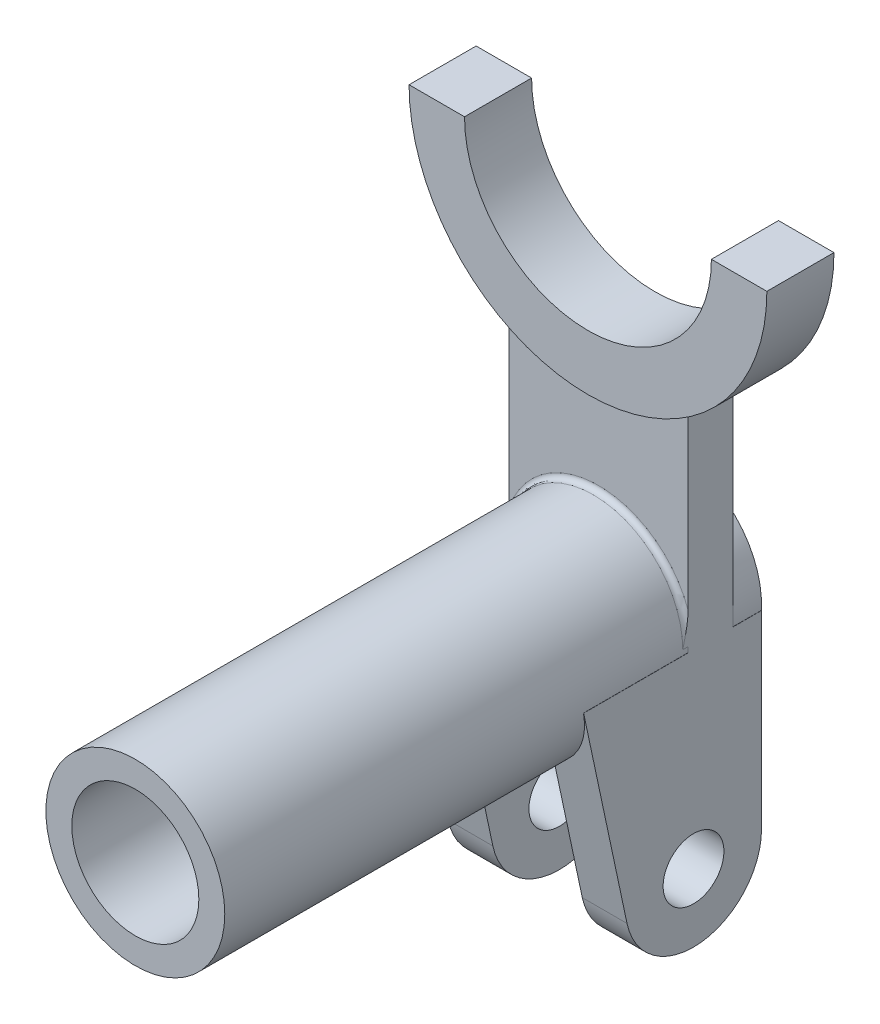
ISO-10303-21;
HEADER;
FILE_DESCRIPTION(('STEP AP214'),'2;1');
FILE_NAME('part.step','',(''),(''),'','','');
FILE_SCHEMA(('AUTOMOTIVE_DESIGN { 1 0 10303 214 1 1 1 1 }'));
ENDSEC;
DATA;
#1=APPLICATION_CONTEXT('core data for automotive mechanical design processes');
#2=APPLICATION_PROTOCOL_DEFINITION('international standard','automotive_design',2000,#1);
#3=PRODUCT_CONTEXT('',#1,'mechanical');
#4=PRODUCT('Part','Part','',(#3));
#5=PRODUCT_RELATED_PRODUCT_CATEGORY('part','',(#4));
#6=PRODUCT_DEFINITION_FORMATION('','',#4);
#7=PRODUCT_DEFINITION_CONTEXT('part definition',#1,'design');
#8=PRODUCT_DEFINITION('design','',#6,#7);
#9=PRODUCT_DEFINITION_SHAPE('','',#8);
#10=(LENGTH_UNIT() NAMED_UNIT(*) SI_UNIT(.MILLI.,.METRE.));
#11=(NAMED_UNIT(*) PLANE_ANGLE_UNIT() SI_UNIT($,.RADIAN.));
#12=(NAMED_UNIT(*) SI_UNIT($,.STERADIAN.) SOLID_ANGLE_UNIT());
#13=UNCERTAINTY_MEASURE_WITH_UNIT(LENGTH_MEASURE(1.E-05),#10,'distance_accuracy_value','');
#14=(GEOMETRIC_REPRESENTATION_CONTEXT(3) GLOBAL_UNCERTAINTY_ASSIGNED_CONTEXT((#13)) GLOBAL_UNIT_ASSIGNED_CONTEXT((#10,
#11,#12)) REPRESENTATION_CONTEXT('',''));
#15=CARTESIAN_POINT('',(0.,0.,0.));
#16=DIRECTION('',(0.,0.,1.));
#17=DIRECTION('',(1.,0.,0.));
#18=AXIS2_PLACEMENT_3D('',#15,#16,#17);
#19=CARTESIAN_POINT('',(0.,-23.876,14.224));
#20=DIRECTION('',(0.,0.,-1.));
#21=DIRECTION('',(-1.,0.,0.));
#22=AXIS2_PLACEMENT_3D('',#19,#20,#21);
#23=TOROIDAL_SURFACE('',#22,26.924,1.524);
#24=CARTESIAN_POINT('',(0.,-23.876,12.7));
#25=DIRECTION('',(0.,0.,-1.));
#26=DIRECTION('',(-1.,0.,0.));
#27=AXIS2_PLACEMENT_3D('',#24,#25,#26);
#28=CIRCLE('',#27,26.924);
#29=CARTESIAN_POINT('',(-25.4,-14.9461749177265,12.7));
#30=VERTEX_POINT('',#29);
#31=CARTESIAN_POINT('',(25.4,-14.9461749177265,12.7));
#32=VERTEX_POINT('',#31);
#33=EDGE_CURVE('E385',#30,#32,#28,.T.);
#34=ORIENTED_EDGE('',*,*,#33,.F.);
#35=CARTESIAN_POINT('',(-25.4,-14.9461749177265,12.7));
#36=CARTESIAN_POINT('',(-25.4,-15.0740375842868,12.7000084620465));
#37=CARTESIAN_POINT('',(-25.4,-15.2018881166341,12.7017691098499));
#38=CARTESIAN_POINT('',(-25.4,-15.4574904425715,12.7084608541815));
#39=CARTESIAN_POINT('',(-25.4,-15.5852422470816,12.7133915265934));
#40=CARTESIAN_POINT('',(-25.4,-15.9681135423277,12.7324298690946));
#41=CARTESIAN_POINT('',(-25.4,-16.2230249571202,12.7507847966138));
#42=CARTESIAN_POINT('',(-25.4,-16.7311741672679,12.7966875269757));
#43=CARTESIAN_POINT('',(-25.4,-16.9844147057849,12.8242061018476));
#44=CARTESIAN_POINT('',(-25.4,-17.4899886677331,12.8868734370775));
#45=CARTESIAN_POINT('',(-25.4,-17.7423218979983,12.9220237345578));
#46=CARTESIAN_POINT('',(-25.4,-18.4869910816426,13.0352528831892));
#47=CARTESIAN_POINT('',(-25.4,-18.9779685609184,13.1222278131092));
#48=CARTESIAN_POINT('',(-25.4,-19.9567094408191,13.312513501668));
#49=CARTESIAN_POINT('',(-25.4,-20.4444723935607,13.4158264885931));
#50=CARTESIAN_POINT('',(-25.4,-21.9055406344503,13.7413419029003));
#51=CARTESIAN_POINT('',(-25.4,-22.8753573115823,13.9788936302423));
#52=CARTESIAN_POINT('',(-25.4,-23.8553603436057,14.2189443621557));
#53=CARTESIAN_POINT('',(-25.4,-23.8656801766422,14.2214721950521));
#54=CARTESIAN_POINT('',(-25.4,-23.876,14.224));
#55=B_SPLINE_CURVE_WITH_KNOTS('',3,(#35,#36,#37,#38,#39,#40,#41,#42,#43,#44,#45,#46,#47,#48,#49,
#50,#51,#52,#53,#54),.UNSPECIFIED.,.F.,.F.,(4,2,2,2,2,2,2,2,2,4),(0.,0.3835570202057,
0.767062735159043,1.53354655366014,2.29760867853487,3.06182483787625,4.55721320548729,
6.05280569968116,9.04785110632418,9.07972586122545),.UNSPECIFIED.);
#56=CARTESIAN_POINT('',(-25.4,-23.876,14.224));
#57=VERTEX_POINT('',#56);
#58=EDGE_CURVE('E46',#30,#57,#55,.T.);
#59=ORIENTED_EDGE('',*,*,#58,.T.);
#60=CARTESIAN_POINT('',(0.,-23.876,14.224));
#61=DIRECTION('',(0.,0.,-1.));
#62=DIRECTION('',(-1.,0.,0.));
#63=AXIS2_PLACEMENT_3D('',#60,#61,#62);
#64=CIRCLE('',#63,25.4);
#65=CARTESIAN_POINT('',(25.4,-23.876,14.224));
#66=VERTEX_POINT('',#65);
#67=EDGE_CURVE('E391',#66,#57,#64,.F.);
#68=ORIENTED_EDGE('',*,*,#67,.F.);
#69=CARTESIAN_POINT('',(25.4,-14.9461749177265,12.7));
#70=CARTESIAN_POINT('',(25.4,-15.0740375842874,12.7000084620465));
#71=CARTESIAN_POINT('',(25.4,-15.2018881166353,12.70176910985));
#72=CARTESIAN_POINT('',(25.4,-15.4574904425739,12.7084608541816));
#73=CARTESIAN_POINT('',(25.4,-15.5852422470846,12.7133915265935));
#74=CARTESIAN_POINT('',(25.4,-15.9681135423323,12.7324298690949));
#75=CARTESIAN_POINT('',(25.4,-16.2230249571257,12.7507847966142));
#76=CARTESIAN_POINT('',(25.4,-16.7311741672732,12.7966875269763));
#77=CARTESIAN_POINT('',(25.4,-16.984414705789,12.8242061018482));
#78=CARTESIAN_POINT('',(25.4,-17.4899886677351,12.8868734370777));
#79=CARTESIAN_POINT('',(25.4,-17.7423218979993,12.9220237345577));
#80=CARTESIAN_POINT('',(25.4,-18.4869910816421,13.0352528831898));
#81=CARTESIAN_POINT('',(25.4,-18.977968560917,13.1222278131123));
#82=CARTESIAN_POINT('',(25.4,-19.9567094408182,13.3125135016645));
#83=CARTESIAN_POINT('',(25.4,-20.4444723935612,13.4158264885805));
#84=CARTESIAN_POINT('',(25.3999999999999,-21.9055406344422,13.7413419029241));
#85=CARTESIAN_POINT('',(25.3999999999997,-22.8753573115486,13.9788936303752));
#86=CARTESIAN_POINT('',(25.4,-23.8553603436051,14.2189443621585));
#87=CARTESIAN_POINT('',(25.4,-23.8656801766418,14.2214721950535));
#88=CARTESIAN_POINT('',(25.4,-23.876,14.224));
#89=B_SPLINE_CURVE_WITH_KNOTS('',3,(#69,#70,#71,#72,#73,#74,#75,#76,#77,#78,#79,#80,#81,#82,#83,
#84,#85,#86,#87,#88),.UNSPECIFIED.,.F.,.F.,(4,2,2,2,2,2,2,2,2,4),(0.,0.383557020207539,
0.767062735162726,1.5335465536667,2.2976086785379,3.06182483787625,4.55721320548645,
6.05280569967792,9.04785110632423,9.07972586122547),.UNSPECIFIED.);
#90=EDGE_CURVE('E11',#66,#32,#89,.F.);
#91=ORIENTED_EDGE('',*,*,#90,.T.);
#92=EDGE_LOOP('',(#34,#59,#68,#91));
#93=FACE_BOUND('',#92,.T.);
#94=ADVANCED_FACE('F35',(#93),#23,.F.);
#95=CARTESIAN_POINT('',(0.,0.,12.7));
#96=DIRECTION('',(0.,0.,-1.));
#97=DIRECTION('',(-1.,0.,0.));
#98=AXIS2_PLACEMENT_3D('',#95,#96,#97);
#99=PLANE('',#98);
#100=CARTESIAN_POINT('',(0.,-23.876,12.7));
#101=DIRECTION('',(0.,0.,1.));
#102=DIRECTION('',(1.,0.,0.));
#103=AXIS2_PLACEMENT_3D('',#100,#101,#102);
#104=CIRCLE('',#103,25.4);
#105=CARTESIAN_POINT('',(25.3542387777666,-25.4,12.7));
#106=VERTEX_POINT('',#105);
#107=CARTESIAN_POINT('',(25.4,-23.876,12.7));
#108=VERTEX_POINT('',#107);
#109=EDGE_CURVE('E354',#106,#108,#104,.T.);
#110=ORIENTED_EDGE('',*,*,#109,.F.);
#111=DIRECTION('',(1.,0.,0.));
#112=VECTOR('',#111,1.);
#113=CARTESIAN_POINT('',(0.,-25.4,12.7));
#114=LINE('',#113,#112);
#115=CARTESIAN_POINT('',(25.4,-25.4,12.7));
#116=VERTEX_POINT('',#115);
#117=EDGE_CURVE('E250',#106,#116,#114,.T.);
#118=ORIENTED_EDGE('',*,*,#117,.T.);
#119=DIRECTION('',(0.,1.,0.));
#120=VECTOR('',#119,1.);
#121=CARTESIAN_POINT('',(25.4,-77.724,12.7));
#122=LINE('',#121,#120);
#123=EDGE_CURVE('E359',#116,#108,#122,.T.);
#124=ORIENTED_EDGE('',*,*,#123,.T.);
#125=EDGE_LOOP('',(#110,#118,#124));
#126=FACE_BOUND('',#125,.T.);
#127=ADVANCED_FACE('F418',(#126),#99,.F.);
#128=CARTESIAN_POINT('',(0.,0.,0.));
#129=DIRECTION('',(0.,0.,-1.));
#130=DIRECTION('',(-1.,0.,0.));
#131=AXIS2_PLACEMENT_3D('',#128,#129,#130);
#132=PLANE('',#131);
#133=DIRECTION('',(1.,0.,0.));
#134=VECTOR('',#133,1.);
#135=CARTESIAN_POINT('',(0.,-25.4,0.));
#136=LINE('',#135,#134);
#137=CARTESIAN_POINT('',(25.3542387777666,-25.4,0.));
#138=VERTEX_POINT('',#137);
#139=CARTESIAN_POINT('',(25.4,-25.4,0.));
#140=VERTEX_POINT('',#139);
#141=EDGE_CURVE('E245',#138,#140,#136,.T.);
#142=ORIENTED_EDGE('',*,*,#141,.F.);
#143=CARTESIAN_POINT('',(0.,-23.876,0.));
#144=DIRECTION('',(0.,0.,-1.));
#145=DIRECTION('',(-1.,0.,0.));
#146=AXIS2_PLACEMENT_3D('',#143,#144,#145);
#147=CIRCLE('',#146,25.4);
#148=CARTESIAN_POINT('',(25.4,-23.876,0.));
#149=VERTEX_POINT('',#148);
#150=EDGE_CURVE('E376',#149,#138,#147,.T.);
#151=ORIENTED_EDGE('',*,*,#150,.F.);
#152=DIRECTION('',(0.,1.,0.));
#153=VECTOR('',#152,1.);
#154=CARTESIAN_POINT('',(25.4,-77.724,0.));
#155=LINE('',#154,#153);
#156=EDGE_CURVE('E366',#140,#149,#155,.T.);
#157=ORIENTED_EDGE('',*,*,#156,.F.);
#158=EDGE_LOOP('',(#142,#151,#157));
#159=FACE_BOUND('',#158,.T.);
#160=ADVANCED_FACE('F424',(#159),#132,.T.);
#161=CARTESIAN_POINT('',(-25.4,-23.876,0.));
#162=VERTEX_POINT('',#161);
#163=EDGE_CURVE('E379',#162,#149,#147,.T.);
#164=ORIENTED_EDGE('',*,*,#163,.F.);
#165=DIRECTION('',(0.,-1.,0.));
#166=VECTOR('',#165,1.);
#167=CARTESIAN_POINT('',(-25.4,-77.724,0.));
#168=LINE('',#167,#166);
#169=CARTESIAN_POINT('',(-25.4,33.7299094877505,0.));
#170=VERTEX_POINT('',#169);
#171=EDGE_CURVE('E369',#170,#162,#168,.T.);
#172=ORIENTED_EDGE('',*,*,#171,.F.);
#173=CARTESIAN_POINT('',(0.,77.724,0.));
#174=DIRECTION('',(0.,0.,-1.));
#175=DIRECTION('',(-1.,0.,0.));
#176=AXIS2_PLACEMENT_3D('',#173,#174,#175);
#177=CIRCLE('',#176,50.8);
#178=CARTESIAN_POINT('',(25.4,33.7299094877505,0.));
#179=VERTEX_POINT('',#178);
#180=EDGE_CURVE('E372',#179,#170,#177,.T.);
#181=ORIENTED_EDGE('',*,*,#180,.F.);
#182=EDGE_CURVE('E353',#149,#179,#155,.T.);
#183=ORIENTED_EDGE('',*,*,#182,.F.);
#184=EDGE_LOOP('',(#164,#172,#181,#183));
#185=FACE_BOUND('',#184,.T.);
#186=ADVANCED_FACE('F416',(#185),#132,.T.);
#187=DIRECTION('',(0.,-1.,0.));
#188=VECTOR('',#187,1.);
#189=CARTESIAN_POINT('',(-25.4,-77.724,12.7));
#190=LINE('',#189,#188);
#191=CARTESIAN_POINT('',(-25.4,33.7299094877505,12.7));
#192=VERTEX_POINT('',#191);
#193=EDGE_CURVE('E358',#192,#30,#190,.T.);
#194=ORIENTED_EDGE('',*,*,#193,.T.);
#195=ORIENTED_EDGE('',*,*,#33,.T.);
#196=CARTESIAN_POINT('',(25.4,33.7299094877505,12.7));
#197=VERTEX_POINT('',#196);
#198=EDGE_CURVE('E363',#32,#197,#122,.T.);
#199=ORIENTED_EDGE('',*,*,#198,.T.);
#200=CARTESIAN_POINT('',(0.,77.724,12.7));
#201=DIRECTION('',(0.,0.,-1.));
#202=DIRECTION('',(-1.,0.,0.));
#203=AXIS2_PLACEMENT_3D('',#200,#201,#202);
#204=CIRCLE('',#203,50.8);
#205=EDGE_CURVE('E345',#197,#192,#204,.T.);
#206=ORIENTED_EDGE('',*,*,#205,.T.);
#207=EDGE_LOOP('',(#194,#195,#199,#206));
#208=FACE_BOUND('',#207,.T.);
#209=ADVANCED_FACE('F410',(#208),#99,.F.);
#210=CARTESIAN_POINT('',(25.4,-77.724,12.7));
#211=DIRECTION('',(-1.,0.,0.));
#212=DIRECTION('',(0.,0.,1.));
#213=AXIS2_PLACEMENT_3D('',#210,#211,#212);
#214=PLANE('',#213);
#215=CARTESIAN_POINT('',(25.4,-79.248,11.176));
#216=DIRECTION('',(-1.,0.,0.));
#217=DIRECTION('',(0.,0.,1.));
#218=AXIS2_PLACEMENT_3D('',#215,#216,#217);
#219=CIRCLE('',#218,8.636);
#220=CARTESIAN_POINT('',(25.4,-79.248,19.812));
#221=VERTEX_POINT('',#220);
#222=EDGE_CURVE('E228',#221,#221,#219,.T.);
#223=ORIENTED_EDGE('',*,*,#222,.T.);
#224=EDGE_LOOP('',(#223));
#225=FACE_BOUND('',#224,.T.);
#226=ORIENTED_EDGE('',*,*,#123,.F.);
#227=DIRECTION('',(0.,0.,1.));
#228=VECTOR('',#227,1.);
#229=CARTESIAN_POINT('',(25.4,-25.4,42.3770179188738));
#230=LINE('',#229,#228);
#231=CARTESIAN_POINT('',(25.4,-25.4,42.3770179188738));
#232=VERTEX_POINT('',#231);
#233=EDGE_CURVE('E235',#116,#232,#230,.T.);
#234=ORIENTED_EDGE('',*,*,#233,.T.);
#235=DIRECTION('',(0.,-0.978078764918354,-0.208235274667351));
#236=VECTOR('',#235,1.);
#237=CARTESIAN_POINT('',(25.4,-83.2677737421785,30.0568324779839));
#238=LINE('',#237,#236);
#239=CARTESIAN_POINT('',(25.4,-83.2677737421785,30.0568324779839));
#240=VERTEX_POINT('',#239);
#241=EDGE_CURVE('E222',#232,#240,#238,.T.);
#242=ORIENTED_EDGE('',*,*,#241,.T.);
#243=CARTESIAN_POINT('',(25.4,-79.248,11.176));
#244=DIRECTION('',(1.,0.,0.));
#245=DIRECTION('',(0.,0.,-1.));
#246=AXIS2_PLACEMENT_3D('',#243,#244,#245);
#247=CIRCLE('',#246,19.304);
#248=CARTESIAN_POINT('',(25.4,-79.248,-8.128));
#249=VERTEX_POINT('',#248);
#250=EDGE_CURVE('E232',#240,#249,#247,.T.);
#251=ORIENTED_EDGE('',*,*,#250,.T.);
#252=DIRECTION('',(0.,1.,0.));
#253=VECTOR('',#252,1.);
#254=CARTESIAN_POINT('',(25.4,-25.4,-8.128));
#255=LINE('',#254,#253);
#256=CARTESIAN_POINT('',(25.4,-25.4,-8.128));
#257=VERTEX_POINT('',#256);
#258=EDGE_CURVE('E203',#249,#257,#255,.T.);
#259=ORIENTED_EDGE('',*,*,#258,.T.);
#260=EDGE_CURVE('E225',#257,#140,#230,.T.);
#261=ORIENTED_EDGE('',*,*,#260,.T.);
#262=ORIENTED_EDGE('',*,*,#156,.T.);
#263=ORIENTED_EDGE('',*,*,#182,.T.);
#264=DIRECTION('',(0.,0.,1.));
#265=VECTOR('',#264,1.);
#266=CARTESIAN_POINT('',(25.4,33.7299094877505,-3.302));
#267=LINE('',#266,#265);
#268=EDGE_CURVE('E342',#179,#197,#267,.T.);
#269=ORIENTED_EDGE('',*,*,#268,.T.);
#270=ORIENTED_EDGE('',*,*,#198,.F.);
#271=ORIENTED_EDGE('',*,*,#90,.F.);
#272=DIRECTION('',(0.,0.,-1.));
#273=VECTOR('',#272,1.);
#274=CARTESIAN_POINT('',(25.4,-23.876,144.272));
#275=LINE('',#274,#273);
#276=EDGE_CURVE('E388',#108,#66,#275,.F.);
#277=ORIENTED_EDGE('',*,*,#276,.F.);
#278=EDGE_LOOP('',(#226,#234,#242,#251,#259,#261,#262,#263,#269,#270,#271,#277));
#279=FACE_BOUND('',#278,.T.);
#280=ADVANCED_FACE('F404',(#225,#279),#214,.F.);
#281=CARTESIAN_POINT('',(-25.4,-77.724,12.7));
#282=DIRECTION('',(1.,0.,0.));
#283=DIRECTION('',(0.,0.,-1.));
#284=AXIS2_PLACEMENT_3D('',#281,#282,#283);
#285=PLANE('',#284);
#286=CARTESIAN_POINT('',(-25.4,-79.248,11.176));
#287=DIRECTION('',(-1.,0.,0.));
#288=DIRECTION('',(0.,0.,1.));
#289=AXIS2_PLACEMENT_3D('',#286,#287,#288);
#290=CIRCLE('',#289,8.636);
#291=CARTESIAN_POINT('',(-25.4,-79.248,19.812));
#292=VERTEX_POINT('',#291);
#293=EDGE_CURVE('E384',#292,#292,#290,.T.);
#294=ORIENTED_EDGE('',*,*,#293,.F.);
#295=EDGE_LOOP('',(#294));
#296=FACE_BOUND('',#295,.T.);
#297=CARTESIAN_POINT('',(-25.4,-25.4,0.));
#298=VERTEX_POINT('',#297);
#299=EDGE_CURVE('E368',#162,#298,#168,.T.);
#300=ORIENTED_EDGE('',*,*,#299,.T.);
#301=DIRECTION('',(0.,0.,-1.));
#302=VECTOR('',#301,1.);
#303=CARTESIAN_POINT('',(-25.4,-25.4,-8.128));
#304=LINE('',#303,#302);
#305=CARTESIAN_POINT('',(-25.4,-25.4,-8.128));
#306=VERTEX_POINT('',#305);
#307=EDGE_CURVE('E272',#298,#306,#304,.T.);
#308=ORIENTED_EDGE('',*,*,#307,.T.);
#309=DIRECTION('',(0.,-1.,0.));
#310=VECTOR('',#309,1.);
#311=CARTESIAN_POINT('',(-25.4,-79.248,-8.128));
#312=LINE('',#311,#310);
#313=CARTESIAN_POINT('',(-25.4,-79.248,-8.128));
#314=VERTEX_POINT('',#313);
#315=EDGE_CURVE('E261',#306,#314,#312,.T.);
#316=ORIENTED_EDGE('',*,*,#315,.T.);
#317=CARTESIAN_POINT('',(-25.4,-79.248,11.176));
#318=DIRECTION('',(-1.,0.,0.));
#319=DIRECTION('',(0.,0.,1.));
#320=AXIS2_PLACEMENT_3D('',#317,#318,#319);
#321=CIRCLE('',#320,19.304);
#322=CARTESIAN_POINT('',(-25.4,-83.2677737421785,30.0568324779839));
#323=VERTEX_POINT('',#322);
#324=EDGE_CURVE('E256',#314,#323,#321,.T.);
#325=ORIENTED_EDGE('',*,*,#324,.T.);
#326=DIRECTION('',(0.,0.978078764918354,0.208235274667351));
#327=VECTOR('',#326,1.);
#328=CARTESIAN_POINT('',(-25.4,-25.4,42.3770179188738));
#329=LINE('',#328,#327);
#330=CARTESIAN_POINT('',(-25.4,-25.4,42.3770179188738));
#331=VERTEX_POINT('',#330);
#332=EDGE_CURVE('E269',#323,#331,#329,.T.);
#333=ORIENTED_EDGE('',*,*,#332,.T.);
#334=CARTESIAN_POINT('',(-25.4,-25.4,12.7));
#335=VERTEX_POINT('',#334);
#336=EDGE_CURVE('E273',#331,#335,#304,.T.);
#337=ORIENTED_EDGE('',*,*,#336,.T.);
#338=CARTESIAN_POINT('',(-25.4,-23.876,12.7));
#339=VERTEX_POINT('',#338);
#340=EDGE_CURVE('E362',#339,#335,#190,.T.);
#341=ORIENTED_EDGE('',*,*,#340,.F.);
#342=DIRECTION('',(0.,0.,-1.));
#343=VECTOR('',#342,1.);
#344=CARTESIAN_POINT('',(-25.4,-23.876,144.272));
#345=LINE('',#344,#343);
#346=EDGE_CURVE('E394',#57,#339,#345,.T.);
#347=ORIENTED_EDGE('',*,*,#346,.F.);
#348=ORIENTED_EDGE('',*,*,#58,.F.);
#349=ORIENTED_EDGE('',*,*,#193,.F.);
#350=DIRECTION('',(0.,0.,1.));
#351=VECTOR('',#350,1.);
#352=CARTESIAN_POINT('',(-25.4,33.7299094877505,-3.302));
#353=LINE('',#352,#351);
#354=EDGE_CURVE('E334',#192,#170,#353,.F.);
#355=ORIENTED_EDGE('',*,*,#354,.T.);
#356=ORIENTED_EDGE('',*,*,#171,.T.);
#357=EDGE_LOOP('',(#300,#308,#316,#325,#333,#337,#341,#347,#348,#349,#355,#356));
#358=FACE_BOUND('',#357,.T.);
#359=ADVANCED_FACE('F399',(#296,#358),#285,.F.);
#360=ORIENTED_EDGE('',*,*,#340,.T.);
#361=DIRECTION('',(1.,0.,0.));
#362=VECTOR('',#361,1.);
#363=CARTESIAN_POINT('',(0.,-25.4,12.7));
#364=LINE('',#363,#362);
#365=CARTESIAN_POINT('',(-25.3542387777665,-25.4,12.7));
#366=VERTEX_POINT('',#365);
#367=EDGE_CURVE('E296',#335,#366,#364,.T.);
#368=ORIENTED_EDGE('',*,*,#367,.T.);
#369=EDGE_CURVE('E357',#339,#366,#104,.T.);
#370=ORIENTED_EDGE('',*,*,#369,.F.);
#371=EDGE_LOOP('',(#360,#368,#370));
#372=FACE_BOUND('',#371,.T.);
#373=ADVANCED_FACE('F403',(#372),#99,.F.);
#374=DIRECTION('',(1.,0.,0.));
#375=VECTOR('',#374,1.);
#376=CARTESIAN_POINT('',(0.,-25.4,0.));
#377=LINE('',#376,#375);
#378=CARTESIAN_POINT('',(-25.3542387777665,-25.4,0.));
#379=VERTEX_POINT('',#378);
#380=EDGE_CURVE('E291',#298,#379,#377,.T.);
#381=ORIENTED_EDGE('',*,*,#380,.F.);
#382=ORIENTED_EDGE('',*,*,#299,.F.);
#383=EDGE_CURVE('E375',#379,#162,#147,.T.);
#384=ORIENTED_EDGE('',*,*,#383,.F.);
#385=EDGE_LOOP('',(#381,#382,#384));
#386=FACE_BOUND('',#385,.T.);
#387=ADVANCED_FACE('F406',(#386),#132,.T.);
#388=CARTESIAN_POINT('',(0.,-23.876,144.272));
#389=DIRECTION('',(0.,0.,1.));
#390=DIRECTION('',(1.,0.,0.));
#391=AXIS2_PLACEMENT_3D('',#388,#389,#390);
#392=PLANE('',#391);
#393=CARTESIAN_POINT('',(0.,-23.876,144.272));
#394=DIRECTION('',(0.,0.,1.));
#395=DIRECTION('',(1.,0.,0.));
#396=AXIS2_PLACEMENT_3D('',#393,#394,#395);
#397=CIRCLE('',#396,25.4);
#398=CARTESIAN_POINT('',(25.4,-23.876,144.272));
#399=VERTEX_POINT('',#398);
#400=EDGE_CURVE('E350',#399,#399,#397,.T.);
#401=ORIENTED_EDGE('',*,*,#400,.T.);
#402=EDGE_LOOP('',(#401));
#403=FACE_BOUND('',#402,.T.);
#404=CARTESIAN_POINT('',(0.,-23.876,144.272));
#405=DIRECTION('',(0.,0.,1.));
#406=DIRECTION('',(1.,0.,0.));
#407=AXIS2_PLACEMENT_3D('',#404,#405,#406);
#408=CIRCLE('',#407,18.034);
#409=CARTESIAN_POINT('',(18.034,-23.876,144.272));
#410=VERTEX_POINT('',#409);
#411=EDGE_CURVE('E347',#410,#410,#408,.T.);
#412=ORIENTED_EDGE('',*,*,#411,.F.);
#413=EDGE_LOOP('',(#412));
#414=FACE_BOUND('',#413,.T.);
#415=ADVANCED_FACE('F647',(#403,#414),#392,.T.);
#416=CARTESIAN_POINT('',(0.,-23.876,144.272));
#417=DIRECTION('',(0.,0.,-1.));
#418=DIRECTION('',(-1.,0.,0.));
#419=AXIS2_PLACEMENT_3D('',#416,#417,#418);
#420=CYLINDRICAL_SURFACE('',#419,25.4);
#421=ORIENTED_EDGE('',*,*,#400,.F.);
#422=EDGE_LOOP('',(#421));
#423=FACE_BOUND('',#422,.T.);
#424=ORIENTED_EDGE('',*,*,#67,.T.);
#425=ORIENTED_EDGE('',*,*,#346,.T.);
#426=ORIENTED_EDGE('',*,*,#369,.T.);
#427=DIRECTION('',(0.,0.,-1.));
#428=VECTOR('',#427,1.);
#429=CARTESIAN_POINT('',(-25.3542387777665,-25.4,144.272));
#430=LINE('',#429,#428);
#431=CARTESIAN_POINT('',(-25.3542387777665,-25.4,42.3770179188738));
#432=VERTEX_POINT('',#431);
#433=EDGE_CURVE('E293',#366,#432,#430,.F.);
#434=ORIENTED_EDGE('',*,*,#433,.T.);
#435=CARTESIAN_POINT('',(0.,-23.876,42.7014811113852));
#436=DIRECTION('',(0.,-0.208235274667351,0.978078764918354));
#437=DIRECTION('',(0.,-0.978078764918354,-0.208235274667351));
#438=AXIS2_PLACEMENT_3D('',#435,#436,#437);
#439=ELLIPSE('',#438,25.9692786624606,25.4);
#440=CARTESIAN_POINT('',(-12.7,-45.8730452561247,38.0182583229203));
#441=VERTEX_POINT('',#440);
#442=EDGE_CURVE('E299',#432,#441,#439,.T.);
#443=ORIENTED_EDGE('',*,*,#442,.T.);
#444=DIRECTION('',(0.,0.,1.));
#445=VECTOR('',#444,1.);
#446=CARTESIAN_POINT('',(-12.7,-45.8730452561247,-8.128));
#447=LINE('',#446,#445);
#448=CARTESIAN_POINT('',(-12.7,-45.8730452561247,-8.128));
#449=VERTEX_POINT('',#448);
#450=EDGE_CURVE('E280',#441,#449,#447,.F.);
#451=ORIENTED_EDGE('',*,*,#450,.T.);
#452=CARTESIAN_POINT('',(0.,-23.876,-8.128));
#453=DIRECTION('',(0.,0.,1.));
#454=DIRECTION('',(1.,0.,0.));
#455=AXIS2_PLACEMENT_3D('',#452,#453,#454);
#456=CIRCLE('',#455,25.4);
#457=CARTESIAN_POINT('',(12.7,-45.8730452561248,-8.128));
#458=VERTEX_POINT('',#457);
#459=EDGE_CURVE('E306',#449,#458,#456,.T.);
#460=ORIENTED_EDGE('',*,*,#459,.T.);
#461=DIRECTION('',(0.,0.,1.));
#462=VECTOR('',#461,1.);
#463=CARTESIAN_POINT('',(12.7,-45.8730452561248,-8.128));
#464=LINE('',#463,#462);
#465=CARTESIAN_POINT('',(12.7,-45.8730452561248,38.0182583229203));
#466=VERTEX_POINT('',#465);
#467=EDGE_CURVE('E216',#458,#466,#464,.T.);
#468=ORIENTED_EDGE('',*,*,#467,.T.);
#469=CARTESIAN_POINT('',(0.,-23.876,42.7014811113852));
#470=DIRECTION('',(0.,-0.208235274667351,0.978078764918354));
#471=DIRECTION('',(0.,-0.978078764918354,-0.208235274667351));
#472=AXIS2_PLACEMENT_3D('',#469,#470,#471);
#473=ELLIPSE('',#472,25.9692786624606,25.4);
#474=CARTESIAN_POINT('',(25.3542387777666,-25.4,42.3770179188738));
#475=VERTEX_POINT('',#474);
#476=EDGE_CURVE('E253',#466,#475,#473,.T.);
#477=ORIENTED_EDGE('',*,*,#476,.T.);
#478=DIRECTION('',(0.,0.,-1.));
#479=VECTOR('',#478,1.);
#480=CARTESIAN_POINT('',(25.3542387777666,-25.4,144.272));
#481=LINE('',#480,#479);
#482=EDGE_CURVE('E247',#475,#106,#481,.T.);
#483=ORIENTED_EDGE('',*,*,#482,.T.);
#484=ORIENTED_EDGE('',*,*,#109,.T.);
#485=ORIENTED_EDGE('',*,*,#276,.T.);
#486=EDGE_LOOP('',(#424,#425,#426,#434,#443,#451,#460,#468,#477,#483,#484,#485));
#487=FACE_BOUND('',#486,.T.);
#488=ADVANCED_FACE('F472',(#423,#487),#420,.T.);
#489=CARTESIAN_POINT('',(0.,-23.876,144.272));
#490=DIRECTION('',(0.,0.,-1.));
#491=DIRECTION('',(-1.,0.,0.));
#492=AXIS2_PLACEMENT_3D('',#489,#490,#491);
#493=CYLINDRICAL_SURFACE('',#492,18.034);
#494=CARTESIAN_POINT('',(0.,-23.876,-8.128));
#495=DIRECTION('',(0.,0.,-1.));
#496=DIRECTION('',(-1.,0.,0.));
#497=AXIS2_PLACEMENT_3D('',#494,#495,#496);
#498=CIRCLE('',#497,18.034);
#499=CARTESIAN_POINT('',(-18.034,-23.876,-8.128));
#500=VERTEX_POINT('',#499);
#501=EDGE_CURVE('E302',#500,#500,#498,.T.);
#502=ORIENTED_EDGE('',*,*,#501,.T.);
#503=EDGE_LOOP('',(#502));
#504=FACE_BOUND('',#503,.T.);
#505=ORIENTED_EDGE('',*,*,#411,.T.);
#506=EDGE_LOOP('',(#505));
#507=FACE_BOUND('',#506,.T.);
#508=ADVANCED_FACE('F566',(#504,#507),#493,.F.);
#509=CARTESIAN_POINT('',(0.,77.724,-3.302));
#510=DIRECTION('',(0.,0.,1.));
#511=DIRECTION('',(1.,0.,0.));
#512=AXIS2_PLACEMENT_3D('',#509,#510,#511);
#513=CYLINDRICAL_SURFACE('',#512,35.052);
#514=DIRECTION('',(0.,0.,1.));
#515=VECTOR('',#514,1.);
#516=CARTESIAN_POINT('',(-35.052,77.724,-3.302));
#517=LINE('',#516,#515);
#518=CARTESIAN_POINT('',(-35.052,77.724,-3.302));
#519=VERTEX_POINT('',#518);
#520=CARTESIAN_POINT('',(-35.052,77.724,15.748));
#521=VERTEX_POINT('',#520);
#522=EDGE_CURVE('E331',#519,#521,#517,.T.);
#523=ORIENTED_EDGE('',*,*,#522,.T.);
#524=CARTESIAN_POINT('',(0.,77.724,15.748));
#525=DIRECTION('',(0.,0.,1.));
#526=DIRECTION('',(1.,0.,0.));
#527=AXIS2_PLACEMENT_3D('',#524,#525,#526);
#528=CIRCLE('',#527,35.052);
#529=CARTESIAN_POINT('',(35.052,77.724,15.748));
#530=VERTEX_POINT('',#529);
#531=EDGE_CURVE('E308',#521,#530,#528,.T.);
#532=ORIENTED_EDGE('',*,*,#531,.T.);
#533=DIRECTION('',(0.,0.,1.));
#534=VECTOR('',#533,1.);
#535=CARTESIAN_POINT('',(35.052,77.724,-3.302));
#536=LINE('',#535,#534);
#537=CARTESIAN_POINT('',(35.052,77.724,-3.302));
#538=VERTEX_POINT('',#537);
#539=EDGE_CURVE('E332',#538,#530,#536,.T.);
#540=ORIENTED_EDGE('',*,*,#539,.F.);
#541=CARTESIAN_POINT('',(0.,77.724,-3.302));
#542=DIRECTION('',(0.,0.,1.));
#543=DIRECTION('',(1.,0.,0.));
#544=AXIS2_PLACEMENT_3D('',#541,#542,#543);
#545=CIRCLE('',#544,35.052);
#546=EDGE_CURVE('E320',#519,#538,#545,.T.);
#547=ORIENTED_EDGE('',*,*,#546,.F.);
#548=EDGE_LOOP('',(#523,#532,#540,#547));
#549=FACE_BOUND('',#548,.T.);
#550=ADVANCED_FACE('F569',(#549),#513,.F.);
#551=CARTESIAN_POINT('',(0.,77.724,-3.302));
#552=DIRECTION('',(0.,0.,1.));
#553=DIRECTION('',(1.,0.,0.));
#554=AXIS2_PLACEMENT_3D('',#551,#552,#553);
#555=CYLINDRICAL_SURFACE('',#554,50.8);
#556=DIRECTION('',(0.,0.,1.));
#557=VECTOR('',#556,1.);
#558=CARTESIAN_POINT('',(50.8,77.724,-3.302));
#559=LINE('',#558,#557);
#560=CARTESIAN_POINT('',(50.8,77.724,-3.302));
#561=VERTEX_POINT('',#560);
#562=CARTESIAN_POINT('',(50.8,77.724,15.748));
#563=VERTEX_POINT('',#562);
#564=EDGE_CURVE('E335',#561,#563,#559,.T.);
#565=ORIENTED_EDGE('',*,*,#564,.T.);
#566=CARTESIAN_POINT('',(0.,77.724,15.748));
#567=DIRECTION('',(0.,0.,1.));
#568=DIRECTION('',(1.,0.,0.));
#569=AXIS2_PLACEMENT_3D('',#566,#567,#568);
#570=CIRCLE('',#569,50.8);
#571=CARTESIAN_POINT('',(-50.8,77.724,15.748));
#572=VERTEX_POINT('',#571);
#573=EDGE_CURVE('E314',#572,#563,#570,.T.);
#574=ORIENTED_EDGE('',*,*,#573,.F.);
#575=DIRECTION('',(0.,0.,1.));
#576=VECTOR('',#575,1.);
#577=CARTESIAN_POINT('',(-50.8,77.724,-3.302));
#578=LINE('',#577,#576);
#579=CARTESIAN_POINT('',(-50.8,77.724,-3.302));
#580=VERTEX_POINT('',#579);
#581=EDGE_CURVE('E337',#580,#572,#578,.T.);
#582=ORIENTED_EDGE('',*,*,#581,.F.);
#583=CARTESIAN_POINT('',(0.,77.724,-3.302));
#584=DIRECTION('',(0.,0.,1.));
#585=DIRECTION('',(1.,0.,0.));
#586=AXIS2_PLACEMENT_3D('',#583,#584,#585);
#587=CIRCLE('',#586,50.8);
#588=EDGE_CURVE('E325',#580,#561,#587,.T.);
#589=ORIENTED_EDGE('',*,*,#588,.T.);
#590=EDGE_LOOP('',(#565,#574,#582,#589));
#591=FACE_BOUND('',#590,.T.);
#592=ORIENTED_EDGE('',*,*,#205,.F.);
#593=ORIENTED_EDGE('',*,*,#268,.F.);
#594=ORIENTED_EDGE('',*,*,#180,.T.);
#595=ORIENTED_EDGE('',*,*,#354,.F.);
#596=EDGE_LOOP('',(#592,#593,#594,#595));
#597=FACE_BOUND('',#596,.T.);
#598=ADVANCED_FACE('F432',(#591,#597),#555,.T.);
#599=CARTESIAN_POINT('',(0.,77.724,-3.302));
#600=DIRECTION('',(0.,1.,0.));
#601=DIRECTION('',(0.,0.,1.));
#602=AXIS2_PLACEMENT_3D('',#599,#600,#601);
#603=PLANE('',#602);
#604=ORIENTED_EDGE('',*,*,#539,.T.);
#605=DIRECTION('',(-1.,0.,0.));
#606=VECTOR('',#605,1.);
#607=CARTESIAN_POINT('',(0.,77.724,15.748));
#608=LINE('',#607,#606);
#609=EDGE_CURVE('E317',#563,#530,#608,.T.);
#610=ORIENTED_EDGE('',*,*,#609,.F.);
#611=ORIENTED_EDGE('',*,*,#564,.F.);
#612=DIRECTION('',(-1.,0.,0.));
#613=VECTOR('',#612,1.);
#614=CARTESIAN_POINT('',(0.,77.724,-3.302));
#615=LINE('',#614,#613);
#616=EDGE_CURVE('E328',#561,#538,#615,.T.);
#617=ORIENTED_EDGE('',*,*,#616,.T.);
#618=EDGE_LOOP('',(#604,#610,#611,#617));
#619=FACE_BOUND('',#618,.T.);
#620=ADVANCED_FACE('F701',(#619),#603,.T.);
#621=CARTESIAN_POINT('',(0.,77.724,-3.302));
#622=DIRECTION('',(0.,1.,0.));
#623=DIRECTION('',(0.,0.,1.));
#624=AXIS2_PLACEMENT_3D('',#621,#622,#623);
#625=PLANE('',#624);
#626=ORIENTED_EDGE('',*,*,#581,.T.);
#627=DIRECTION('',(-1.,0.,0.));
#628=VECTOR('',#627,1.);
#629=CARTESIAN_POINT('',(0.,77.724,15.748));
#630=LINE('',#629,#628);
#631=EDGE_CURVE('E311',#521,#572,#630,.T.);
#632=ORIENTED_EDGE('',*,*,#631,.F.);
#633=ORIENTED_EDGE('',*,*,#522,.F.);
#634=DIRECTION('',(-1.,0.,0.));
#635=VECTOR('',#634,1.);
#636=CARTESIAN_POINT('',(0.,77.724,-3.302));
#637=LINE('',#636,#635);
#638=EDGE_CURVE('E322',#519,#580,#637,.T.);
#639=ORIENTED_EDGE('',*,*,#638,.T.);
#640=EDGE_LOOP('',(#626,#632,#633,#639));
#641=FACE_BOUND('',#640,.T.);
#642=ADVANCED_FACE('F689',(#641),#625,.T.);
#643=CARTESIAN_POINT('',(0.,0.,-3.302));
#644=DIRECTION('',(0.,0.,1.));
#645=DIRECTION('',(1.,0.,0.));
#646=AXIS2_PLACEMENT_3D('',#643,#644,#645);
#647=PLANE('',#646);
#648=ORIENTED_EDGE('',*,*,#546,.T.);
#649=ORIENTED_EDGE('',*,*,#616,.F.);
#650=ORIENTED_EDGE('',*,*,#588,.F.);
#651=ORIENTED_EDGE('',*,*,#638,.F.);
#652=EDGE_LOOP('',(#648,#649,#650,#651));
#653=FACE_BOUND('',#652,.T.);
#654=ADVANCED_FACE('F678',(#653),#647,.F.);
#655=CARTESIAN_POINT('',(0.,0.,15.748));
#656=DIRECTION('',(0.,0.,1.));
#657=DIRECTION('',(1.,0.,0.));
#658=AXIS2_PLACEMENT_3D('',#655,#656,#657);
#659=PLANE('',#658);
#660=ORIENTED_EDGE('',*,*,#531,.F.);
#661=ORIENTED_EDGE('',*,*,#631,.T.);
#662=ORIENTED_EDGE('',*,*,#573,.T.);
#663=ORIENTED_EDGE('',*,*,#609,.T.);
#664=EDGE_LOOP('',(#660,#661,#662,#663));
#665=FACE_BOUND('',#664,.T.);
#666=ADVANCED_FACE('F601',(#665),#659,.T.);
#667=CARTESIAN_POINT('',(0.,-23.876,-8.128));
#668=DIRECTION('',(0.,0.,1.));
#669=DIRECTION('',(1.,0.,0.));
#670=AXIS2_PLACEMENT_3D('',#667,#668,#669);
#671=CYLINDRICAL_SURFACE('',#670,25.4);
#672=DIRECTION('',(0.,0.,1.));
#673=VECTOR('',#672,1.);
#674=CARTESIAN_POINT('',(25.3542387777666,-25.4,-8.128));
#675=LINE('',#674,#673);
#676=CARTESIAN_POINT('',(25.3542387777666,-25.4,-8.128));
#677=VERTEX_POINT('',#676);
#678=EDGE_CURVE('E243',#677,#138,#675,.T.);
#679=ORIENTED_EDGE('',*,*,#678,.F.);
#680=CARTESIAN_POINT('',(-25.3542387777665,-25.4,-8.128));
#681=VERTEX_POINT('',#680);
#682=EDGE_CURVE('E305',#677,#681,#456,.T.);
#683=ORIENTED_EDGE('',*,*,#682,.T.);
#684=DIRECTION('',(0.,0.,1.));
#685=VECTOR('',#684,1.);
#686=CARTESIAN_POINT('',(-25.3542387777665,-25.4,-8.128));
#687=LINE('',#686,#685);
#688=EDGE_CURVE('E288',#379,#681,#687,.F.);
#689=ORIENTED_EDGE('',*,*,#688,.F.);
#690=ORIENTED_EDGE('',*,*,#383,.T.);
#691=ORIENTED_EDGE('',*,*,#163,.T.);
#692=ORIENTED_EDGE('',*,*,#150,.T.);
#693=EDGE_LOOP('',(#679,#683,#689,#690,#691,#692));
#694=FACE_BOUND('',#693,.T.);
#695=ADVANCED_FACE('F450',(#694),#671,.T.);
#696=CARTESIAN_POINT('',(0.,-23.876,-8.128));
#697=DIRECTION('',(0.,0.,1.));
#698=DIRECTION('',(1.,0.,0.));
#699=AXIS2_PLACEMENT_3D('',#696,#697,#698);
#700=PLANE('',#699);
#701=ORIENTED_EDGE('',*,*,#501,.F.);
#702=EDGE_LOOP('',(#701));
#703=FACE_BOUND('',#702,.T.);
#704=ORIENTED_EDGE('',*,*,#682,.F.);
#705=DIRECTION('',(1.,0.,0.));
#706=VECTOR('',#705,1.);
#707=CARTESIAN_POINT('',(12.7,-25.4,-8.128));
#708=LINE('',#707,#706);
#709=EDGE_CURVE('E208',#677,#257,#708,.T.);
#710=ORIENTED_EDGE('',*,*,#709,.T.);
#711=ORIENTED_EDGE('',*,*,#258,.F.);
#712=DIRECTION('',(1.,0.,0.));
#713=VECTOR('',#712,1.);
#714=CARTESIAN_POINT('',(12.7,-79.248,-8.128));
#715=LINE('',#714,#713);
#716=CARTESIAN_POINT('',(12.7,-79.248,-8.128));
#717=VERTEX_POINT('',#716);
#718=EDGE_CURVE('E195',#717,#249,#715,.T.);
#719=ORIENTED_EDGE('',*,*,#718,.F.);
#720=DIRECTION('',(0.,1.,0.));
#721=VECTOR('',#720,1.);
#722=CARTESIAN_POINT('',(12.7,-25.4,-8.128));
#723=LINE('',#722,#721);
#724=EDGE_CURVE('E200',#717,#458,#723,.T.);
#725=ORIENTED_EDGE('',*,*,#724,.T.);
#726=ORIENTED_EDGE('',*,*,#459,.F.);
#727=DIRECTION('',(0.,-1.,0.));
#728=VECTOR('',#727,1.);
#729=CARTESIAN_POINT('',(-12.7,-79.248,-8.128));
#730=LINE('',#729,#728);
#731=CARTESIAN_POINT('',(-12.7,-79.248,-8.128));
#732=VERTEX_POINT('',#731);
#733=EDGE_CURVE('E264',#449,#732,#730,.T.);
#734=ORIENTED_EDGE('',*,*,#733,.T.);
#735=DIRECTION('',(-1.,0.,0.));
#736=VECTOR('',#735,1.);
#737=CARTESIAN_POINT('',(-12.7,-79.248,-8.128));
#738=LINE('',#737,#736);
#739=EDGE_CURVE('E278',#732,#314,#738,.T.);
#740=ORIENTED_EDGE('',*,*,#739,.T.);
#741=ORIENTED_EDGE('',*,*,#315,.F.);
#742=DIRECTION('',(-1.,0.,0.));
#743=VECTOR('',#742,1.);
#744=CARTESIAN_POINT('',(-12.7,-25.4,-8.128));
#745=LINE('',#744,#743);
#746=EDGE_CURVE('E281',#681,#306,#745,.T.);
#747=ORIENTED_EDGE('',*,*,#746,.F.);
#748=EDGE_LOOP('',(#704,#710,#711,#719,#725,#726,#734,#740,#741,#747));
#749=FACE_BOUND('',#748,.T.);
#750=ADVANCED_FACE('F198',(#703,#749),#700,.F.);
#751=CARTESIAN_POINT('',(-12.7,-25.4,42.3770179188738));
#752=DIRECTION('',(0.,-0.208235274667351,0.978078764918354));
#753=DIRECTION('',(0.,-0.978078764918354,-0.208235274667351));
#754=AXIS2_PLACEMENT_3D('',#751,#752,#753);
#755=PLANE('',#754);
#756=ORIENTED_EDGE('',*,*,#442,.F.);
#757=DIRECTION('',(-1.,0.,0.));
#758=VECTOR('',#757,1.);
#759=CARTESIAN_POINT('',(-12.7,-25.4,42.3770179188738));
#760=LINE('',#759,#758);
#761=EDGE_CURVE('E283',#432,#331,#760,.T.);
#762=ORIENTED_EDGE('',*,*,#761,.T.);
#763=ORIENTED_EDGE('',*,*,#332,.F.);
#764=DIRECTION('',(-1.,0.,0.));
#765=VECTOR('',#764,1.);
#766=CARTESIAN_POINT('',(-12.7,-83.2677737421785,30.0568324779839));
#767=LINE('',#766,#765);
#768=CARTESIAN_POINT('',(-12.7,-83.2677737421785,30.0568324779839));
#769=VERTEX_POINT('',#768);
#770=EDGE_CURVE('E266',#769,#323,#767,.T.);
#771=ORIENTED_EDGE('',*,*,#770,.F.);
#772=DIRECTION('',(0.,0.978078764918354,0.208235274667351));
#773=VECTOR('',#772,1.);
#774=CARTESIAN_POINT('',(-12.7,-25.4,42.3770179188738));
#775=LINE('',#774,#773);
#776=EDGE_CURVE('E260',#769,#441,#775,.T.);
#777=ORIENTED_EDGE('',*,*,#776,.T.);
#778=EDGE_LOOP('',(#756,#762,#763,#771,#777));
#779=FACE_BOUND('',#778,.T.);
#780=ADVANCED_FACE('F461',(#779),#755,.T.);
#781=CARTESIAN_POINT('',(-12.7,-25.4,-8.128));
#782=DIRECTION('',(0.,1.,0.));
#783=DIRECTION('',(0.,0.,1.));
#784=AXIS2_PLACEMENT_3D('',#781,#782,#783);
#785=PLANE('',#784);
#786=ORIENTED_EDGE('',*,*,#307,.F.);
#787=ORIENTED_EDGE('',*,*,#380,.T.);
#788=ORIENTED_EDGE('',*,*,#688,.T.);
#789=ORIENTED_EDGE('',*,*,#746,.T.);
#790=EDGE_LOOP('',(#786,#787,#788,#789));
#791=FACE_BOUND('',#790,.T.);
#792=ADVANCED_FACE('F446',(#791),#785,.T.);
#793=CARTESIAN_POINT('',(-12.7,-79.248,11.176));
#794=DIRECTION('',(-1.,0.,0.));
#795=DIRECTION('',(0.,0.,1.));
#796=AXIS2_PLACEMENT_3D('',#793,#794,#795);
#797=CYLINDRICAL_SURFACE('',#796,19.304);
#798=ORIENTED_EDGE('',*,*,#324,.F.);
#799=ORIENTED_EDGE('',*,*,#739,.F.);
#800=CARTESIAN_POINT('',(-12.7,-79.248,11.176));
#801=DIRECTION('',(-1.,0.,0.));
#802=DIRECTION('',(0.,0.,1.));
#803=AXIS2_PLACEMENT_3D('',#800,#801,#802);
#804=CIRCLE('',#803,19.304);
#805=EDGE_CURVE('E257',#732,#769,#804,.T.);
#806=ORIENTED_EDGE('',*,*,#805,.T.);
#807=ORIENTED_EDGE('',*,*,#770,.T.);
#808=EDGE_LOOP('',(#798,#799,#806,#807));
#809=FACE_BOUND('',#808,.T.);
#810=ADVANCED_FACE('F457',(#809),#797,.T.);
#811=CARTESIAN_POINT('',(-12.7,-79.248,11.176));
#812=DIRECTION('',(-1.,0.,0.));
#813=DIRECTION('',(0.,0.,1.));
#814=AXIS2_PLACEMENT_3D('',#811,#812,#813);
#815=PLANE('',#814);
#816=CARTESIAN_POINT('',(-12.7,-79.248,11.176));
#817=DIRECTION('',(-1.,0.,0.));
#818=DIRECTION('',(0.,0.,1.));
#819=AXIS2_PLACEMENT_3D('',#816,#817,#818);
#820=CIRCLE('',#819,8.636);
#821=CARTESIAN_POINT('',(-12.7,-79.248,19.812));
#822=VERTEX_POINT('',#821);
#823=EDGE_CURVE('E383',#822,#822,#820,.T.);
#824=ORIENTED_EDGE('',*,*,#823,.T.);
#825=EDGE_LOOP('',(#824));
#826=FACE_BOUND('',#825,.T.);
#827=ORIENTED_EDGE('',*,*,#450,.F.);
#828=ORIENTED_EDGE('',*,*,#776,.F.);
#829=ORIENTED_EDGE('',*,*,#805,.F.);
#830=ORIENTED_EDGE('',*,*,#733,.F.);
#831=EDGE_LOOP('',(#827,#828,#829,#830));
#832=FACE_BOUND('',#831,.T.);
#833=ADVANCED_FACE('F496',(#826,#832),#815,.F.);
#834=ORIENTED_EDGE('',*,*,#367,.F.);
#835=ORIENTED_EDGE('',*,*,#336,.F.);
#836=ORIENTED_EDGE('',*,*,#761,.F.);
#837=ORIENTED_EDGE('',*,*,#433,.F.);
#838=EDGE_LOOP('',(#834,#835,#836,#837));
#839=FACE_BOUND('',#838,.T.);
#840=ADVANCED_FACE('F465',(#839),#785,.T.);
#841=CARTESIAN_POINT('',(12.7,-25.4,42.3770179188738));
#842=DIRECTION('',(0.,1.,0.));
#843=DIRECTION('',(0.,0.,1.));
#844=AXIS2_PLACEMENT_3D('',#841,#842,#843);
#845=PLANE('',#844);
#846=ORIENTED_EDGE('',*,*,#678,.T.);
#847=ORIENTED_EDGE('',*,*,#141,.T.);
#848=ORIENTED_EDGE('',*,*,#260,.F.);
#849=ORIENTED_EDGE('',*,*,#709,.F.);
#850=EDGE_LOOP('',(#846,#847,#848,#849));
#851=FACE_BOUND('',#850,.T.);
#852=ADVANCED_FACE('F488',(#851),#845,.T.);
#853=CARTESIAN_POINT('',(12.7,-83.2677737421785,30.0568324779839));
#854=DIRECTION('',(0.,-0.208235274667351,0.978078764918354));
#855=DIRECTION('',(0.,-0.978078764918354,-0.208235274667351));
#856=AXIS2_PLACEMENT_3D('',#853,#854,#855);
#857=PLANE('',#856);
#858=ORIENTED_EDGE('',*,*,#476,.F.);
#859=DIRECTION('',(0.,-0.978078764918354,-0.208235274667351));
#860=VECTOR('',#859,1.);
#861=CARTESIAN_POINT('',(12.7,-83.2677737421785,30.0568324779839));
#862=LINE('',#861,#860);
#863=CARTESIAN_POINT('',(12.7,-83.2677737421785,30.0568324779839));
#864=VERTEX_POINT('',#863);
#865=EDGE_CURVE('E209',#466,#864,#862,.T.);
#866=ORIENTED_EDGE('',*,*,#865,.T.);
#867=DIRECTION('',(1.,0.,0.));
#868=VECTOR('',#867,1.);
#869=CARTESIAN_POINT('',(12.7,-83.2677737421785,30.0568324779839));
#870=LINE('',#869,#868);
#871=EDGE_CURVE('E221',#864,#240,#870,.T.);
#872=ORIENTED_EDGE('',*,*,#871,.T.);
#873=ORIENTED_EDGE('',*,*,#241,.F.);
#874=DIRECTION('',(1.,0.,0.));
#875=VECTOR('',#874,1.);
#876=CARTESIAN_POINT('',(12.7,-25.4,42.3770179188738));
#877=LINE('',#876,#875);
#878=EDGE_CURVE('E239',#475,#232,#877,.T.);
#879=ORIENTED_EDGE('',*,*,#878,.F.);
#880=EDGE_LOOP('',(#858,#866,#872,#873,#879));
#881=FACE_BOUND('',#880,.T.);
#882=ADVANCED_FACE('F481',(#881),#857,.T.);
#883=CARTESIAN_POINT('',(12.7,-79.248,11.176));
#884=DIRECTION('',(1.,0.,0.));
#885=DIRECTION('',(0.,0.,-1.));
#886=AXIS2_PLACEMENT_3D('',#883,#884,#885);
#887=CYLINDRICAL_SURFACE('',#886,19.304);
#888=ORIENTED_EDGE('',*,*,#250,.F.);
#889=ORIENTED_EDGE('',*,*,#871,.F.);
#890=CARTESIAN_POINT('',(12.7,-79.248,11.176));
#891=DIRECTION('',(1.,0.,0.));
#892=DIRECTION('',(0.,0.,-1.));
#893=AXIS2_PLACEMENT_3D('',#890,#891,#892);
#894=CIRCLE('',#893,19.304);
#895=EDGE_CURVE('E215',#864,#717,#894,.T.);
#896=ORIENTED_EDGE('',*,*,#895,.T.);
#897=ORIENTED_EDGE('',*,*,#718,.T.);
#898=EDGE_LOOP('',(#888,#889,#896,#897));
#899=FACE_BOUND('',#898,.T.);
#900=ADVANCED_FACE('F220',(#899),#887,.T.);
#901=CARTESIAN_POINT('',(12.7,-79.248,11.176));
#902=DIRECTION('',(1.,0.,0.));
#903=DIRECTION('',(0.,0.,-1.));
#904=AXIS2_PLACEMENT_3D('',#901,#902,#903);
#905=PLANE('',#904);
#906=CARTESIAN_POINT('',(12.7,-79.248,11.176));
#907=DIRECTION('',(1.,0.,0.));
#908=DIRECTION('',(0.,0.,-1.));
#909=AXIS2_PLACEMENT_3D('',#906,#907,#908);
#910=CIRCLE('',#909,8.636);
#911=CARTESIAN_POINT('',(12.7,-79.248,2.54));
#912=VERTEX_POINT('',#911);
#913=EDGE_CURVE('E380',#912,#912,#910,.T.);
#914=ORIENTED_EDGE('',*,*,#913,.T.);
#915=EDGE_LOOP('',(#914));
#916=FACE_BOUND('',#915,.T.);
#917=ORIENTED_EDGE('',*,*,#865,.F.);
#918=ORIENTED_EDGE('',*,*,#467,.F.);
#919=ORIENTED_EDGE('',*,*,#724,.F.);
#920=ORIENTED_EDGE('',*,*,#895,.F.);
#921=EDGE_LOOP('',(#917,#918,#919,#920));
#922=FACE_BOUND('',#921,.T.);
#923=ADVANCED_FACE('F214',(#916,#922),#905,.F.);
#924=ORIENTED_EDGE('',*,*,#117,.F.);
#925=ORIENTED_EDGE('',*,*,#482,.F.);
#926=ORIENTED_EDGE('',*,*,#878,.T.);
#927=ORIENTED_EDGE('',*,*,#233,.F.);
#928=EDGE_LOOP('',(#924,#925,#926,#927));
#929=FACE_BOUND('',#928,.T.);
#930=ADVANCED_FACE('F477',(#929),#845,.T.);
#931=CARTESIAN_POINT('',(50.8,-79.248,11.176));
#932=DIRECTION('',(-1.,0.,0.));
#933=DIRECTION('',(0.,0.,1.));
#934=AXIS2_PLACEMENT_3D('',#931,#932,#933);
#935=CYLINDRICAL_SURFACE('',#934,8.636);
#936=ORIENTED_EDGE('',*,*,#913,.F.);
#937=EDGE_LOOP('',(#936));
#938=FACE_BOUND('',#937,.T.);
#939=ORIENTED_EDGE('',*,*,#222,.F.);
#940=EDGE_LOOP('',(#939));
#941=FACE_BOUND('',#940,.T.);
#942=ADVANCED_FACE('F500',(#938,#941),#935,.F.);
#943=ORIENTED_EDGE('',*,*,#293,.T.);
#944=EDGE_LOOP('',(#943));
#945=FACE_BOUND('',#944,.T.);
#946=ORIENTED_EDGE('',*,*,#823,.F.);
#947=EDGE_LOOP('',(#946));
#948=FACE_BOUND('',#947,.T.);
#949=ADVANCED_FACE('F505',(#945,#948),#935,.F.);
#950=CLOSED_SHELL('',(#94,#127,#160,#186,#209,#280,#359,#373,#387,#415,#488,#508,#550,#598,#620,
#642,#654,#666,#695,#750,#780,#792,#810,#833,#840,#852,#882,#900,#923,#930,#942,#949));
#951=MANIFOLD_SOLID_BREP('B2',#950);
#952=ADVANCED_BREP_SHAPE_REPRESENTATION('',(#18,#951),#14);
#953=SHAPE_DEFINITION_REPRESENTATION(#9,#952);
ENDSEC;
END-ISO-10303-21;
